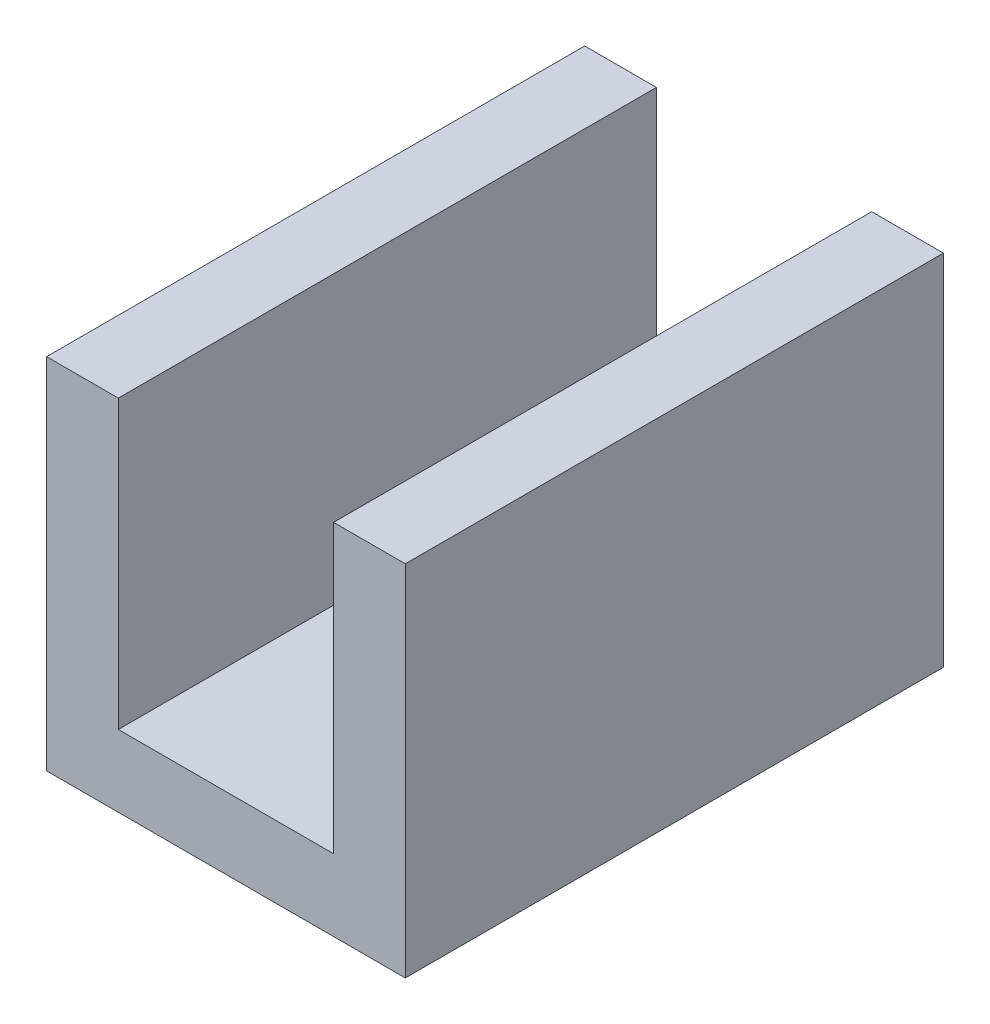
ISO-10303-21;
HEADER;
FILE_DESCRIPTION(('STEP AP214'),'2;1');
FILE_NAME('part.step','',(''),(''),'','','');
FILE_SCHEMA(('AUTOMOTIVE_DESIGN { 1 0 10303 214 1 1 1 1 }'));
ENDSEC;
DATA;
#1=APPLICATION_CONTEXT('core data for automotive mechanical design processes');
#2=APPLICATION_PROTOCOL_DEFINITION('international standard','automotive_design',2000,#1);
#3=PRODUCT_CONTEXT('',#1,'mechanical');
#4=PRODUCT('Part','Part','',(#3));
#5=PRODUCT_RELATED_PRODUCT_CATEGORY('part','',(#4));
#6=PRODUCT_DEFINITION_FORMATION('','',#4);
#7=PRODUCT_DEFINITION_CONTEXT('part definition',#1,'design');
#8=PRODUCT_DEFINITION('design','',#6,#7);
#9=PRODUCT_DEFINITION_SHAPE('','',#8);
#10=(LENGTH_UNIT() NAMED_UNIT(*) SI_UNIT(.MILLI.,.METRE.));
#11=(NAMED_UNIT(*) PLANE_ANGLE_UNIT() SI_UNIT($,.RADIAN.));
#12=(NAMED_UNIT(*) SI_UNIT($,.STERADIAN.) SOLID_ANGLE_UNIT());
#13=UNCERTAINTY_MEASURE_WITH_UNIT(LENGTH_MEASURE(1.E-05),#10,'distance_accuracy_value','');
#14=(GEOMETRIC_REPRESENTATION_CONTEXT(3) GLOBAL_UNCERTAINTY_ASSIGNED_CONTEXT((#13)) GLOBAL_UNIT_ASSIGNED_CONTEXT((#10,
#11,#12)) REPRESENTATION_CONTEXT('',''));
#15=CARTESIAN_POINT('',(0.,0.,0.));
#16=DIRECTION('',(0.,0.,1.));
#17=DIRECTION('',(1.,0.,0.));
#18=AXIS2_PLACEMENT_3D('',#15,#16,#17);
#19=CARTESIAN_POINT('',(254.,0.,-381.));
#20=DIRECTION('',(0.,-1.,0.));
#21=DIRECTION('',(1.,0.,0.));
#22=AXIS2_PLACEMENT_3D('',#19,#20,#21);
#23=PLANE('',#22);
#24=DIRECTION('',(1.,0.,0.));
#25=VECTOR('',#24,1.);
#26=CARTESIAN_POINT('',(254.,0.,0.));
#27=LINE('',#26,#25);
#28=CARTESIAN_POINT('',(0.,0.,0.));
#29=VERTEX_POINT('',#28);
#30=CARTESIAN_POINT('',(254.,0.,0.));
#31=VERTEX_POINT('',#30);
#32=EDGE_CURVE('E128',#29,#31,#27,.T.);
#33=ORIENTED_EDGE('',*,*,#32,.F.);
#34=DIRECTION('',(0.,0.,1.));
#35=VECTOR('',#34,1.);
#36=CARTESIAN_POINT('',(0.,0.,-381.));
#37=LINE('',#36,#35);
#38=CARTESIAN_POINT('',(0.,0.,-381.));
#39=VERTEX_POINT('',#38);
#40=EDGE_CURVE('E11',#39,#29,#37,.T.);
#41=ORIENTED_EDGE('',*,*,#40,.F.);
#42=DIRECTION('',(1.,0.,0.));
#43=VECTOR('',#42,1.);
#44=CARTESIAN_POINT('',(254.,0.,-381.));
#45=LINE('',#44,#43);
#46=CARTESIAN_POINT('',(254.,0.,-381.));
#47=VERTEX_POINT('',#46);
#48=EDGE_CURVE('E148',#39,#47,#45,.T.);
#49=ORIENTED_EDGE('',*,*,#48,.T.);
#50=DIRECTION('',(0.,0.,1.));
#51=VECTOR('',#50,1.);
#52=CARTESIAN_POINT('',(254.,0.,-381.));
#53=LINE('',#52,#51);
#54=EDGE_CURVE('E34',#47,#31,#53,.T.);
#55=ORIENTED_EDGE('',*,*,#54,.T.);
#56=EDGE_LOOP('',(#33,#41,#49,#55));
#57=FACE_BOUND('',#56,.T.);
#58=ADVANCED_FACE('F31',(#57),#23,.T.);
#59=CARTESIAN_POINT('',(0.,0.,-381.));
#60=DIRECTION('',(-1.,0.,0.));
#61=DIRECTION('',(0.,0.,1.));
#62=AXIS2_PLACEMENT_3D('',#59,#60,#61);
#63=PLANE('',#62);
#64=DIRECTION('',(0.,-1.,0.));
#65=VECTOR('',#64,1.);
#66=CARTESIAN_POINT('',(0.,0.,0.));
#67=LINE('',#66,#65);
#68=CARTESIAN_POINT('',(0.,254.,0.));
#69=VERTEX_POINT('',#68);
#70=EDGE_CURVE('E146',#69,#29,#67,.T.);
#71=ORIENTED_EDGE('',*,*,#70,.F.);
#72=DIRECTION('',(0.,0.,1.));
#73=VECTOR('',#72,1.);
#74=CARTESIAN_POINT('',(0.,254.,-381.));
#75=LINE('',#74,#73);
#76=CARTESIAN_POINT('',(0.,254.,-381.));
#77=VERTEX_POINT('',#76);
#78=EDGE_CURVE('E40',#77,#69,#75,.T.);
#79=ORIENTED_EDGE('',*,*,#78,.F.);
#80=DIRECTION('',(0.,-1.,0.));
#81=VECTOR('',#80,1.);
#82=CARTESIAN_POINT('',(0.,0.,-381.));
#83=LINE('',#82,#81);
#84=EDGE_CURVE('E118',#77,#39,#83,.T.);
#85=ORIENTED_EDGE('',*,*,#84,.T.);
#86=ORIENTED_EDGE('',*,*,#40,.T.);
#87=EDGE_LOOP('',(#71,#79,#85,#86));
#88=FACE_BOUND('',#87,.T.);
#89=ADVANCED_FACE('F160',(#88),#63,.T.);
#90=CARTESIAN_POINT('',(0.,254.,-381.));
#91=DIRECTION('',(0.,1.,0.));
#92=DIRECTION('',(0.,0.,1.));
#93=AXIS2_PLACEMENT_3D('',#90,#91,#92);
#94=PLANE('',#93);
#95=DIRECTION('',(-1.,0.,0.));
#96=VECTOR('',#95,1.);
#97=CARTESIAN_POINT('',(0.,254.,0.));
#98=LINE('',#97,#96);
#99=CARTESIAN_POINT('',(50.8,254.,0.));
#100=VERTEX_POINT('',#99);
#101=EDGE_CURVE('E105',#100,#69,#98,.T.);
#102=ORIENTED_EDGE('',*,*,#101,.F.);
#103=DIRECTION('',(0.,0.,1.));
#104=VECTOR('',#103,1.);
#105=CARTESIAN_POINT('',(50.8,254.,-381.));
#106=LINE('',#105,#104);
#107=CARTESIAN_POINT('',(50.8,254.,-381.));
#108=VERTEX_POINT('',#107);
#109=EDGE_CURVE('E100',#108,#100,#106,.T.);
#110=ORIENTED_EDGE('',*,*,#109,.F.);
#111=DIRECTION('',(-1.,0.,0.));
#112=VECTOR('',#111,1.);
#113=CARTESIAN_POINT('',(0.,254.,-381.));
#114=LINE('',#113,#112);
#115=EDGE_CURVE('E103',#108,#77,#114,.T.);
#116=ORIENTED_EDGE('',*,*,#115,.T.);
#117=ORIENTED_EDGE('',*,*,#78,.T.);
#118=EDGE_LOOP('',(#102,#110,#116,#117));
#119=FACE_BOUND('',#118,.T.);
#120=ADVANCED_FACE('F102',(#119),#94,.T.);
#121=CARTESIAN_POINT('',(50.8,254.,-381.));
#122=DIRECTION('',(1.,0.,0.));
#123=DIRECTION('',(0.,1.,0.));
#124=AXIS2_PLACEMENT_3D('',#121,#122,#123);
#125=PLANE('',#124);
#126=DIRECTION('',(0.,1.,0.));
#127=VECTOR('',#126,1.);
#128=CARTESIAN_POINT('',(50.8,254.,0.));
#129=LINE('',#128,#127);
#130=CARTESIAN_POINT('',(50.8,50.8,0.));
#131=VERTEX_POINT('',#130);
#132=EDGE_CURVE('E143',#131,#100,#129,.T.);
#133=ORIENTED_EDGE('',*,*,#132,.F.);
#134=DIRECTION('',(0.,0.,1.));
#135=VECTOR('',#134,1.);
#136=CARTESIAN_POINT('',(50.8,50.8,-381.));
#137=LINE('',#136,#135);
#138=CARTESIAN_POINT('',(50.8,50.8,-381.));
#139=VERTEX_POINT('',#138);
#140=EDGE_CURVE('E110',#139,#131,#137,.T.);
#141=ORIENTED_EDGE('',*,*,#140,.F.);
#142=DIRECTION('',(0.,1.,0.));
#143=VECTOR('',#142,1.);
#144=CARTESIAN_POINT('',(50.8,254.,-381.));
#145=LINE('',#144,#143);
#146=EDGE_CURVE('E116',#139,#108,#145,.T.);
#147=ORIENTED_EDGE('',*,*,#146,.T.);
#148=ORIENTED_EDGE('',*,*,#109,.T.);
#149=EDGE_LOOP('',(#133,#141,#147,#148));
#150=FACE_BOUND('',#149,.T.);
#151=ADVANCED_FACE('F120',(#150),#125,.T.);
#152=CARTESIAN_POINT('',(50.8,50.8,-381.));
#153=DIRECTION('',(0.,1.,0.));
#154=DIRECTION('',(0.,0.,1.));
#155=AXIS2_PLACEMENT_3D('',#152,#153,#154);
#156=PLANE('',#155);
#157=DIRECTION('',(-1.,0.,0.));
#158=VECTOR('',#157,1.);
#159=CARTESIAN_POINT('',(50.8,50.8,0.));
#160=LINE('',#159,#158);
#161=CARTESIAN_POINT('',(203.2,50.8,0.));
#162=VERTEX_POINT('',#161);
#163=EDGE_CURVE('E140',#162,#131,#160,.T.);
#164=ORIENTED_EDGE('',*,*,#163,.F.);
#165=DIRECTION('',(0.,0.,1.));
#166=VECTOR('',#165,1.);
#167=CARTESIAN_POINT('',(203.2,50.8,-381.));
#168=LINE('',#167,#166);
#169=CARTESIAN_POINT('',(203.2,50.8,-381.));
#170=VERTEX_POINT('',#169);
#171=EDGE_CURVE('E152',#170,#162,#168,.T.);
#172=ORIENTED_EDGE('',*,*,#171,.F.);
#173=DIRECTION('',(-1.,0.,0.));
#174=VECTOR('',#173,1.);
#175=CARTESIAN_POINT('',(50.8,50.8,-381.));
#176=LINE('',#175,#174);
#177=EDGE_CURVE('E121',#170,#139,#176,.T.);
#178=ORIENTED_EDGE('',*,*,#177,.T.);
#179=ORIENTED_EDGE('',*,*,#140,.T.);
#180=EDGE_LOOP('',(#164,#172,#178,#179));
#181=FACE_BOUND('',#180,.T.);
#182=ADVANCED_FACE('F173',(#181),#156,.T.);
#183=CARTESIAN_POINT('',(203.2,50.8,-381.));
#184=DIRECTION('',(-1.,0.,0.));
#185=DIRECTION('',(0.,0.,1.));
#186=AXIS2_PLACEMENT_3D('',#183,#184,#185);
#187=PLANE('',#186);
#188=DIRECTION('',(0.,-1.,0.));
#189=VECTOR('',#188,1.);
#190=CARTESIAN_POINT('',(203.2,50.8,0.));
#191=LINE('',#190,#189);
#192=CARTESIAN_POINT('',(203.2,254.,0.));
#193=VERTEX_POINT('',#192);
#194=EDGE_CURVE('E137',#193,#162,#191,.T.);
#195=ORIENTED_EDGE('',*,*,#194,.F.);
#196=DIRECTION('',(0.,0.,1.));
#197=VECTOR('',#196,1.);
#198=CARTESIAN_POINT('',(203.2,254.,-381.));
#199=LINE('',#198,#197);
#200=CARTESIAN_POINT('',(203.2,254.,-381.));
#201=VERTEX_POINT('',#200);
#202=EDGE_CURVE('E154',#201,#193,#199,.T.);
#203=ORIENTED_EDGE('',*,*,#202,.F.);
#204=DIRECTION('',(0.,-1.,0.));
#205=VECTOR('',#204,1.);
#206=CARTESIAN_POINT('',(203.2,50.8,-381.));
#207=LINE('',#206,#205);
#208=EDGE_CURVE('E123',#201,#170,#207,.T.);
#209=ORIENTED_EDGE('',*,*,#208,.T.);
#210=ORIENTED_EDGE('',*,*,#171,.T.);
#211=EDGE_LOOP('',(#195,#203,#209,#210));
#212=FACE_BOUND('',#211,.T.);
#213=ADVANCED_FACE('F176',(#212),#187,.T.);
#214=CARTESIAN_POINT('',(203.2,254.,-381.));
#215=DIRECTION('',(0.,1.,0.));
#216=DIRECTION('',(0.,0.,1.));
#217=AXIS2_PLACEMENT_3D('',#214,#215,#216);
#218=PLANE('',#217);
#219=DIRECTION('',(-1.,0.,0.));
#220=VECTOR('',#219,1.);
#221=CARTESIAN_POINT('',(203.2,254.,0.));
#222=LINE('',#221,#220);
#223=CARTESIAN_POINT('',(254.,254.,0.));
#224=VERTEX_POINT('',#223);
#225=EDGE_CURVE('E134',#224,#193,#222,.T.);
#226=ORIENTED_EDGE('',*,*,#225,.F.);
#227=DIRECTION('',(0.,0.,1.));
#228=VECTOR('',#227,1.);
#229=CARTESIAN_POINT('',(254.,254.,-381.));
#230=LINE('',#229,#228);
#231=CARTESIAN_POINT('',(254.,254.,-381.));
#232=VERTEX_POINT('',#231);
#233=EDGE_CURVE('E155',#232,#224,#230,.T.);
#234=ORIENTED_EDGE('',*,*,#233,.F.);
#235=DIRECTION('',(-1.,0.,0.));
#236=VECTOR('',#235,1.);
#237=CARTESIAN_POINT('',(203.2,254.,-381.));
#238=LINE('',#237,#236);
#239=EDGE_CURVE('E251',#232,#201,#238,.T.);
#240=ORIENTED_EDGE('',*,*,#239,.T.);
#241=ORIENTED_EDGE('',*,*,#202,.T.);
#242=EDGE_LOOP('',(#226,#234,#240,#241));
#243=FACE_BOUND('',#242,.T.);
#244=ADVANCED_FACE('F180',(#243),#218,.T.);
#245=CARTESIAN_POINT('',(254.,254.,-381.));
#246=DIRECTION('',(1.,0.,0.));
#247=DIRECTION('',(0.,1.,0.));
#248=AXIS2_PLACEMENT_3D('',#245,#246,#247);
#249=PLANE('',#248);
#250=DIRECTION('',(0.,1.,0.));
#251=VECTOR('',#250,1.);
#252=CARTESIAN_POINT('',(254.,254.,0.));
#253=LINE('',#252,#251);
#254=EDGE_CURVE('E131',#31,#224,#253,.T.);
#255=ORIENTED_EDGE('',*,*,#254,.F.);
#256=ORIENTED_EDGE('',*,*,#54,.F.);
#257=DIRECTION('',(0.,1.,0.));
#258=VECTOR('',#257,1.);
#259=CARTESIAN_POINT('',(254.,254.,-381.));
#260=LINE('',#259,#258);
#261=EDGE_CURVE('E252',#47,#232,#260,.T.);
#262=ORIENTED_EDGE('',*,*,#261,.T.);
#263=ORIENTED_EDGE('',*,*,#233,.T.);
#264=EDGE_LOOP('',(#255,#256,#262,#263));
#265=FACE_BOUND('',#264,.T.);
#266=ADVANCED_FACE('F157',(#265),#249,.T.);
#267=CARTESIAN_POINT('',(0.,0.,-381.));
#268=DIRECTION('',(0.,0.,-1.));
#269=DIRECTION('',(-1.,0.,0.));
#270=AXIS2_PLACEMENT_3D('',#267,#268,#269);
#271=PLANE('',#270);
#272=ORIENTED_EDGE('',*,*,#48,.F.);
#273=ORIENTED_EDGE('',*,*,#84,.F.);
#274=ORIENTED_EDGE('',*,*,#115,.F.);
#275=ORIENTED_EDGE('',*,*,#146,.F.);
#276=ORIENTED_EDGE('',*,*,#177,.F.);
#277=ORIENTED_EDGE('',*,*,#208,.F.);
#278=ORIENTED_EDGE('',*,*,#239,.F.);
#279=ORIENTED_EDGE('',*,*,#261,.F.);
#280=EDGE_LOOP('',(#272,#273,#274,#275,#276,#277,#278,#279));
#281=FACE_BOUND('',#280,.T.);
#282=ADVANCED_FACE('F114',(#281),#271,.T.);
#283=CARTESIAN_POINT('',(0.,0.,0.));
#284=DIRECTION('',(0.,0.,-1.));
#285=DIRECTION('',(-1.,0.,0.));
#286=AXIS2_PLACEMENT_3D('',#283,#284,#285);
#287=PLANE('',#286);
#288=ORIENTED_EDGE('',*,*,#32,.T.);
#289=ORIENTED_EDGE('',*,*,#254,.T.);
#290=ORIENTED_EDGE('',*,*,#225,.T.);
#291=ORIENTED_EDGE('',*,*,#194,.T.);
#292=ORIENTED_EDGE('',*,*,#163,.T.);
#293=ORIENTED_EDGE('',*,*,#132,.T.);
#294=ORIENTED_EDGE('',*,*,#101,.T.);
#295=ORIENTED_EDGE('',*,*,#70,.T.);
#296=EDGE_LOOP('',(#288,#289,#290,#291,#292,#293,#294,#295));
#297=FACE_BOUND('',#296,.T.);
#298=ADVANCED_FACE('F159',(#297),#287,.F.);
#299=CLOSED_SHELL('',(#58,#89,#120,#151,#182,#213,#244,#266,#282,#298));
#300=MANIFOLD_SOLID_BREP('B2',#299);
#301=ADVANCED_BREP_SHAPE_REPRESENTATION('',(#18,#300),#14);
#302=SHAPE_DEFINITION_REPRESENTATION(#9,#301);
ENDSEC;
END-ISO-10303-21;
